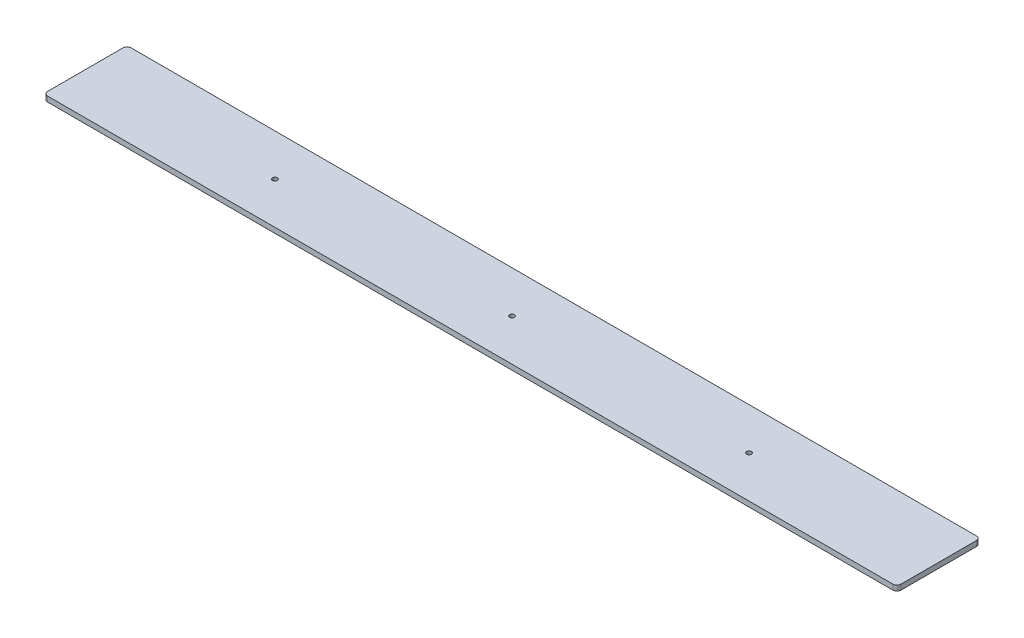
ISO-10303-21;
HEADER;
FILE_DESCRIPTION(('STEP AP214'),'2;1');
FILE_NAME('part.step','',(''),(''),'','','');
FILE_SCHEMA(('AUTOMOTIVE_DESIGN { 1 0 10303 214 1 1 1 1 }'));
ENDSEC;
DATA;
#1=APPLICATION_CONTEXT('core data for automotive mechanical design processes');
#2=APPLICATION_PROTOCOL_DEFINITION('international standard','automotive_design',2000,#1);
#3=PRODUCT_CONTEXT('',#1,'mechanical');
#4=PRODUCT('Part','Part','',(#3));
#5=PRODUCT_RELATED_PRODUCT_CATEGORY('part','',(#4));
#6=PRODUCT_DEFINITION_FORMATION('','',#4);
#7=PRODUCT_DEFINITION_CONTEXT('part definition',#1,'design');
#8=PRODUCT_DEFINITION('design','',#6,#7);
#9=PRODUCT_DEFINITION_SHAPE('','',#8);
#10=(LENGTH_UNIT() NAMED_UNIT(*) SI_UNIT(.MILLI.,.METRE.));
#11=(NAMED_UNIT(*) PLANE_ANGLE_UNIT() SI_UNIT($,.RADIAN.));
#12=(NAMED_UNIT(*) SI_UNIT($,.STERADIAN.) SOLID_ANGLE_UNIT());
#13=UNCERTAINTY_MEASURE_WITH_UNIT(LENGTH_MEASURE(1.E-05),#10,'distance_accuracy_value','');
#14=(GEOMETRIC_REPRESENTATION_CONTEXT(3) GLOBAL_UNCERTAINTY_ASSIGNED_CONTEXT((#13)) GLOBAL_UNIT_ASSIGNED_CONTEXT((#10,
#11,#12)) REPRESENTATION_CONTEXT('',''));
#15=CARTESIAN_POINT('',(0.,0.,0.));
#16=DIRECTION('',(0.,0.,1.));
#17=DIRECTION('',(1.,0.,0.));
#18=AXIS2_PLACEMENT_3D('',#15,#16,#17);
#19=CARTESIAN_POINT('',(259.55625,3.175,25.4));
#20=DIRECTION('',(-1.,0.,0.));
#21=DIRECTION('',(0.,0.,1.));
#22=AXIS2_PLACEMENT_3D('',#19,#20,#21);
#23=PLANE('',#22);
#24=DIRECTION('',(0.,0.,-1.));
#25=VECTOR('',#24,1.);
#26=CARTESIAN_POINT('',(259.55625,0.,25.4));
#27=LINE('',#26,#25);
#28=CARTESIAN_POINT('',(259.55625,0.,22.86));
#29=VERTEX_POINT('',#28);
#30=CARTESIAN_POINT('',(259.55625,0.,-22.86));
#31=VERTEX_POINT('',#30);
#32=EDGE_CURVE('E129',#29,#31,#27,.T.);
#33=ORIENTED_EDGE('',*,*,#32,.T.);
#34=DIRECTION('',(0.,-1.,0.));
#35=VECTOR('',#34,1.);
#36=CARTESIAN_POINT('',(259.55625,3.175,-22.86));
#37=LINE('',#36,#35);
#38=CARTESIAN_POINT('',(259.55625,3.175,-22.86));
#39=VERTEX_POINT('',#38);
#40=EDGE_CURVE('E11',#31,#39,#37,.F.);
#41=ORIENTED_EDGE('',*,*,#40,.T.);
#42=DIRECTION('',(0.,0.,-1.));
#43=VECTOR('',#42,1.);
#44=CARTESIAN_POINT('',(259.55625,3.175,25.4));
#45=LINE('',#44,#43);
#46=CARTESIAN_POINT('',(259.55625,3.175,22.86));
#47=VERTEX_POINT('',#46);
#48=EDGE_CURVE('E127',#47,#39,#45,.T.);
#49=ORIENTED_EDGE('',*,*,#48,.F.);
#50=DIRECTION('',(0.,-1.,0.));
#51=VECTOR('',#50,1.);
#52=CARTESIAN_POINT('',(259.55625,3.175,22.86));
#53=LINE('',#52,#51);
#54=EDGE_CURVE('E41',#47,#29,#53,.T.);
#55=ORIENTED_EDGE('',*,*,#54,.T.);
#56=EDGE_LOOP('',(#33,#41,#49,#55));
#57=FACE_BOUND('',#56,.T.);
#58=ADVANCED_FACE('F33',(#57),#23,.F.);
#59=CARTESIAN_POINT('',(-259.55625,3.175,-25.4));
#60=DIRECTION('',(0.,0.,1.));
#61=DIRECTION('',(1.,0.,0.));
#62=AXIS2_PLACEMENT_3D('',#59,#60,#61);
#63=PLANE('',#62);
#64=DIRECTION('',(-1.,0.,0.));
#65=VECTOR('',#64,1.);
#66=CARTESIAN_POINT('',(-259.55625,0.,-25.4));
#67=LINE('',#66,#65);
#68=CARTESIAN_POINT('',(257.01625,0.,-25.4));
#69=VERTEX_POINT('',#68);
#70=CARTESIAN_POINT('',(-257.01625,0.,-25.4));
#71=VERTEX_POINT('',#70);
#72=EDGE_CURVE('E125',#69,#71,#67,.T.);
#73=ORIENTED_EDGE('',*,*,#72,.T.);
#74=DIRECTION('',(0.,-1.,0.));
#75=VECTOR('',#74,1.);
#76=CARTESIAN_POINT('',(-257.01625,3.175,-25.4));
#77=LINE('',#76,#75);
#78=CARTESIAN_POINT('',(-257.01625,3.175,-25.4));
#79=VERTEX_POINT('',#78);
#80=EDGE_CURVE('E104',#71,#79,#77,.F.);
#81=ORIENTED_EDGE('',*,*,#80,.T.);
#82=DIRECTION('',(-1.,0.,0.));
#83=VECTOR('',#82,1.);
#84=CARTESIAN_POINT('',(-259.55625,3.175,-25.4));
#85=LINE('',#84,#83);
#86=CARTESIAN_POINT('',(257.01625,3.175,-25.4));
#87=VERTEX_POINT('',#86);
#88=EDGE_CURVE('E169',#87,#79,#85,.T.);
#89=ORIENTED_EDGE('',*,*,#88,.F.);
#90=DIRECTION('',(0.,-1.,0.));
#91=VECTOR('',#90,1.);
#92=CARTESIAN_POINT('',(257.01625,3.175,-25.4));
#93=LINE('',#92,#91);
#94=EDGE_CURVE('E109',#87,#69,#93,.T.);
#95=ORIENTED_EDGE('',*,*,#94,.T.);
#96=EDGE_LOOP('',(#73,#81,#89,#95));
#97=FACE_BOUND('',#96,.T.);
#98=ADVANCED_FACE('F213',(#97),#63,.F.);
#99=CARTESIAN_POINT('',(-259.55625,3.175,25.4));
#100=DIRECTION('',(1.,0.,0.));
#101=DIRECTION('',(0.,0.,-1.));
#102=AXIS2_PLACEMENT_3D('',#99,#100,#101);
#103=PLANE('',#102);
#104=DIRECTION('',(0.,0.,1.));
#105=VECTOR('',#104,1.);
#106=CARTESIAN_POINT('',(-259.55625,3.175,25.4));
#107=LINE('',#106,#105);
#108=CARTESIAN_POINT('',(-259.55625,3.175,-22.86));
#109=VERTEX_POINT('',#108);
#110=CARTESIAN_POINT('',(-259.55625,3.175,22.86));
#111=VERTEX_POINT('',#110);
#112=EDGE_CURVE('E118',#109,#111,#107,.T.);
#113=ORIENTED_EDGE('',*,*,#112,.F.);
#114=DIRECTION('',(0.,-1.,0.));
#115=VECTOR('',#114,1.);
#116=CARTESIAN_POINT('',(-259.55625,3.175,-22.86));
#117=LINE('',#116,#115);
#118=CARTESIAN_POINT('',(-259.55625,0.,-22.86));
#119=VERTEX_POINT('',#118);
#120=EDGE_CURVE('E103',#109,#119,#117,.T.);
#121=ORIENTED_EDGE('',*,*,#120,.T.);
#122=DIRECTION('',(0.,0.,1.));
#123=VECTOR('',#122,1.);
#124=CARTESIAN_POINT('',(-259.55625,0.,25.4));
#125=LINE('',#124,#123);
#126=CARTESIAN_POINT('',(-259.55625,0.,22.86));
#127=VERTEX_POINT('',#126);
#128=EDGE_CURVE('E116',#119,#127,#125,.T.);
#129=ORIENTED_EDGE('',*,*,#128,.T.);
#130=DIRECTION('',(0.,-1.,0.));
#131=VECTOR('',#130,1.);
#132=CARTESIAN_POINT('',(-259.55625,3.175,22.86));
#133=LINE('',#132,#131);
#134=EDGE_CURVE('E120',#127,#111,#133,.F.);
#135=ORIENTED_EDGE('',*,*,#134,.T.);
#136=EDGE_LOOP('',(#113,#121,#129,#135));
#137=FACE_BOUND('',#136,.T.);
#138=ADVANCED_FACE('F115',(#137),#103,.F.);
#139=CARTESIAN_POINT('',(-259.55625,3.175,25.4));
#140=DIRECTION('',(0.,0.,-1.));
#141=DIRECTION('',(-1.,0.,0.));
#142=AXIS2_PLACEMENT_3D('',#139,#140,#141);
#143=PLANE('',#142);
#144=DIRECTION('',(1.,0.,0.));
#145=VECTOR('',#144,1.);
#146=CARTESIAN_POINT('',(-259.55625,3.175,25.4));
#147=LINE('',#146,#145);
#148=CARTESIAN_POINT('',(-257.01625,3.175,25.4));
#149=VERTEX_POINT('',#148);
#150=CARTESIAN_POINT('',(257.01625,3.175,25.4));
#151=VERTEX_POINT('',#150);
#152=EDGE_CURVE('E133',#149,#151,#147,.T.);
#153=ORIENTED_EDGE('',*,*,#152,.F.);
#154=DIRECTION('',(0.,-1.,0.));
#155=VECTOR('',#154,1.);
#156=CARTESIAN_POINT('',(-257.01625,3.175,25.4));
#157=LINE('',#156,#155);
#158=CARTESIAN_POINT('',(-257.01625,0.,25.4));
#159=VERTEX_POINT('',#158);
#160=EDGE_CURVE('E150',#149,#159,#157,.T.);
#161=ORIENTED_EDGE('',*,*,#160,.T.);
#162=DIRECTION('',(1.,0.,0.));
#163=VECTOR('',#162,1.);
#164=CARTESIAN_POINT('',(-259.55625,0.,25.4));
#165=LINE('',#164,#163);
#166=CARTESIAN_POINT('',(257.01625,0.,25.4));
#167=VERTEX_POINT('',#166);
#168=EDGE_CURVE('E124',#159,#167,#165,.T.);
#169=ORIENTED_EDGE('',*,*,#168,.T.);
#170=DIRECTION('',(0.,-1.,0.));
#171=VECTOR('',#170,1.);
#172=CARTESIAN_POINT('',(257.01625,3.175,25.4));
#173=LINE('',#172,#171);
#174=EDGE_CURVE('E48',#167,#151,#173,.F.);
#175=ORIENTED_EDGE('',*,*,#174,.T.);
#176=EDGE_LOOP('',(#153,#161,#169,#175));
#177=FACE_BOUND('',#176,.T.);
#178=ADVANCED_FACE('F235',(#177),#143,.F.);
#179=CARTESIAN_POINT('',(0.,3.175,0.));
#180=DIRECTION('',(0.,-1.,0.));
#181=DIRECTION('',(0.,0.,-1.));
#182=AXIS2_PLACEMENT_3D('',#179,#180,#181);
#183=PLANE('',#182);
#184=CARTESIAN_POINT('',(144.19199,3.175,0.));
#185=DIRECTION('',(0.,-1.,0.));
#186=DIRECTION('',(0.,0.,-1.));
#187=AXIS2_PLACEMENT_3D('',#184,#185,#186);
#188=CIRCLE('',#187,1.47320000000001);
#189=CARTESIAN_POINT('',(144.19199,3.175,-1.47319999999998));
#190=VERTEX_POINT('',#189);
#191=EDGE_CURVE('E181',#190,#190,#188,.T.);
#192=ORIENTED_EDGE('',*,*,#191,.T.);
#193=EDGE_LOOP('',(#192));
#194=FACE_BOUND('',#193,.T.);
#195=CARTESIAN_POINT('',(0.,3.175,0.));
#196=DIRECTION('',(0.,-1.,0.));
#197=DIRECTION('',(0.,0.,-1.));
#198=AXIS2_PLACEMENT_3D('',#195,#196,#197);
#199=CIRCLE('',#198,1.4732);
#200=CARTESIAN_POINT('',(0.,3.175,-1.4732));
#201=VERTEX_POINT('',#200);
#202=EDGE_CURVE('E175',#201,#201,#199,.T.);
#203=ORIENTED_EDGE('',*,*,#202,.T.);
#204=EDGE_LOOP('',(#203));
#205=FACE_BOUND('',#204,.T.);
#206=CARTESIAN_POINT('',(-144.19961,3.175,0.));
#207=DIRECTION('',(0.,-1.,0.));
#208=DIRECTION('',(0.,0.,-1.));
#209=AXIS2_PLACEMENT_3D('',#206,#207,#208);
#210=CIRCLE('',#209,1.47320000000001);
#211=CARTESIAN_POINT('',(-144.19961,3.175,-1.47319999999998));
#212=VERTEX_POINT('',#211);
#213=EDGE_CURVE('E162',#212,#212,#210,.T.);
#214=ORIENTED_EDGE('',*,*,#213,.T.);
#215=EDGE_LOOP('',(#214));
#216=FACE_BOUND('',#215,.T.);
#217=ORIENTED_EDGE('',*,*,#88,.T.);
#218=CARTESIAN_POINT('',(-257.01625,3.175,-22.86));
#219=DIRECTION('',(0.,-1.,0.));
#220=DIRECTION('',(0.,0.,-1.));
#221=AXIS2_PLACEMENT_3D('',#218,#219,#220);
#222=CIRCLE('',#221,2.54);
#223=EDGE_CURVE('E147',#79,#109,#222,.F.);
#224=ORIENTED_EDGE('',*,*,#223,.T.);
#225=ORIENTED_EDGE('',*,*,#112,.T.);
#226=CARTESIAN_POINT('',(-257.01625,3.175,22.86));
#227=DIRECTION('',(0.,-1.,0.));
#228=DIRECTION('',(0.,0.,-1.));
#229=AXIS2_PLACEMENT_3D('',#226,#227,#228);
#230=CIRCLE('',#229,2.54);
#231=EDGE_CURVE('E55',#111,#149,#230,.F.);
#232=ORIENTED_EDGE('',*,*,#231,.T.);
#233=ORIENTED_EDGE('',*,*,#152,.T.);
#234=CARTESIAN_POINT('',(257.01625,3.175,22.86));
#235=DIRECTION('',(0.,-1.,0.));
#236=DIRECTION('',(0.,0.,-1.));
#237=AXIS2_PLACEMENT_3D('',#234,#235,#236);
#238=CIRCLE('',#237,2.54);
#239=EDGE_CURVE('E142',#151,#47,#238,.F.);
#240=ORIENTED_EDGE('',*,*,#239,.T.);
#241=ORIENTED_EDGE('',*,*,#48,.T.);
#242=CARTESIAN_POINT('',(257.01625,3.175,-22.86));
#243=DIRECTION('',(0.,-1.,0.));
#244=DIRECTION('',(0.,0.,-1.));
#245=AXIS2_PLACEMENT_3D('',#242,#243,#244);
#246=CIRCLE('',#245,2.54);
#247=EDGE_CURVE('E144',#39,#87,#246,.F.);
#248=ORIENTED_EDGE('',*,*,#247,.T.);
#249=EDGE_LOOP('',(#217,#224,#225,#232,#233,#240,#241,#248));
#250=FACE_BOUND('',#249,.T.);
#251=ADVANCED_FACE('F192',(#194,#205,#216,#250),#183,.F.);
#252=CARTESIAN_POINT('',(0.,0.,0.));
#253=DIRECTION('',(0.,-1.,0.));
#254=DIRECTION('',(0.,0.,-1.));
#255=AXIS2_PLACEMENT_3D('',#252,#253,#254);
#256=PLANE('',#255);
#257=CARTESIAN_POINT('',(144.19199,0.,0.));
#258=DIRECTION('',(0.,-1.,0.));
#259=DIRECTION('',(0.,0.,-1.));
#260=AXIS2_PLACEMENT_3D('',#257,#258,#259);
#261=CIRCLE('',#260,1.47319999999998);
#262=CARTESIAN_POINT('',(144.19199,0.,-1.47319999999995));
#263=VERTEX_POINT('',#262);
#264=EDGE_CURVE('E184',#263,#263,#261,.T.);
#265=ORIENTED_EDGE('',*,*,#264,.F.);
#266=EDGE_LOOP('',(#265));
#267=FACE_BOUND('',#266,.T.);
#268=CARTESIAN_POINT('',(0.,0.,0.));
#269=DIRECTION('',(0.,-1.,0.));
#270=DIRECTION('',(0.,0.,-1.));
#271=AXIS2_PLACEMENT_3D('',#268,#269,#270);
#272=CIRCLE('',#271,1.47319999999999);
#273=CARTESIAN_POINT('',(0.,0.,-1.47319999999999));
#274=VERTEX_POINT('',#273);
#275=EDGE_CURVE('E178',#274,#274,#272,.T.);
#276=ORIENTED_EDGE('',*,*,#275,.F.);
#277=EDGE_LOOP('',(#276));
#278=FACE_BOUND('',#277,.T.);
#279=CARTESIAN_POINT('',(-144.19961,0.,0.));
#280=DIRECTION('',(0.,-1.,0.));
#281=DIRECTION('',(0.,0.,-1.));
#282=AXIS2_PLACEMENT_3D('',#279,#280,#281);
#283=CIRCLE('',#282,1.47319999999998);
#284=CARTESIAN_POINT('',(-144.19961,0.,-1.47319999999995));
#285=VERTEX_POINT('',#284);
#286=EDGE_CURVE('E164',#285,#285,#283,.T.);
#287=ORIENTED_EDGE('',*,*,#286,.F.);
#288=EDGE_LOOP('',(#287));
#289=FACE_BOUND('',#288,.T.);
#290=ORIENTED_EDGE('',*,*,#128,.F.);
#291=CARTESIAN_POINT('',(-257.01625,0.,-22.86));
#292=DIRECTION('',(0.,-1.,0.));
#293=DIRECTION('',(0.,0.,-1.));
#294=AXIS2_PLACEMENT_3D('',#291,#292,#293);
#295=CIRCLE('',#294,2.54);
#296=EDGE_CURVE('E99',#119,#71,#295,.T.);
#297=ORIENTED_EDGE('',*,*,#296,.T.);
#298=ORIENTED_EDGE('',*,*,#72,.F.);
#299=CARTESIAN_POINT('',(257.01625,0.,-22.86));
#300=DIRECTION('',(0.,-1.,0.));
#301=DIRECTION('',(0.,0.,-1.));
#302=AXIS2_PLACEMENT_3D('',#299,#300,#301);
#303=CIRCLE('',#302,2.54);
#304=EDGE_CURVE('E136',#69,#31,#303,.T.);
#305=ORIENTED_EDGE('',*,*,#304,.T.);
#306=ORIENTED_EDGE('',*,*,#32,.F.);
#307=CARTESIAN_POINT('',(257.01625,0.,22.86));
#308=DIRECTION('',(0.,-1.,0.));
#309=DIRECTION('',(0.,0.,-1.));
#310=AXIS2_PLACEMENT_3D('',#307,#308,#309);
#311=CIRCLE('',#310,2.54);
#312=EDGE_CURVE('E119',#29,#167,#311,.T.);
#313=ORIENTED_EDGE('',*,*,#312,.T.);
#314=ORIENTED_EDGE('',*,*,#168,.F.);
#315=CARTESIAN_POINT('',(-257.01625,0.,22.86));
#316=DIRECTION('',(0.,-1.,0.));
#317=DIRECTION('',(0.,0.,-1.));
#318=AXIS2_PLACEMENT_3D('',#315,#316,#317);
#319=CIRCLE('',#318,2.54);
#320=EDGE_CURVE('E110',#159,#127,#319,.T.);
#321=ORIENTED_EDGE('',*,*,#320,.T.);
#322=EDGE_LOOP('',(#290,#297,#298,#305,#306,#313,#314,#321));
#323=FACE_BOUND('',#322,.T.);
#324=ADVANCED_FACE('F122',(#267,#278,#289,#323),#256,.T.);
#325=CARTESIAN_POINT('',(-257.01625,3.175,-22.86));
#326=DIRECTION('',(0.,-1.,0.));
#327=DIRECTION('',(0.,0.,-1.));
#328=AXIS2_PLACEMENT_3D('',#325,#326,#327);
#329=CYLINDRICAL_SURFACE('',#328,2.54);
#330=ORIENTED_EDGE('',*,*,#223,.F.);
#331=ORIENTED_EDGE('',*,*,#80,.F.);
#332=ORIENTED_EDGE('',*,*,#296,.F.);
#333=ORIENTED_EDGE('',*,*,#120,.F.);
#334=EDGE_LOOP('',(#330,#331,#332,#333));
#335=FACE_BOUND('',#334,.T.);
#336=ADVANCED_FACE('F102',(#335),#329,.T.);
#337=CARTESIAN_POINT('',(-257.01625,3.175,22.86));
#338=DIRECTION('',(0.,-1.,0.));
#339=DIRECTION('',(0.,0.,-1.));
#340=AXIS2_PLACEMENT_3D('',#337,#338,#339);
#341=CYLINDRICAL_SURFACE('',#340,2.54);
#342=ORIENTED_EDGE('',*,*,#231,.F.);
#343=ORIENTED_EDGE('',*,*,#134,.F.);
#344=ORIENTED_EDGE('',*,*,#320,.F.);
#345=ORIENTED_EDGE('',*,*,#160,.F.);
#346=EDGE_LOOP('',(#342,#343,#344,#345));
#347=FACE_BOUND('',#346,.T.);
#348=ADVANCED_FACE('F224',(#347),#341,.T.);
#349=CARTESIAN_POINT('',(257.01625,3.175,-22.86));
#350=DIRECTION('',(0.,-1.,0.));
#351=DIRECTION('',(0.,0.,-1.));
#352=AXIS2_PLACEMENT_3D('',#349,#350,#351);
#353=CYLINDRICAL_SURFACE('',#352,2.54);
#354=ORIENTED_EDGE('',*,*,#247,.F.);
#355=ORIENTED_EDGE('',*,*,#40,.F.);
#356=ORIENTED_EDGE('',*,*,#304,.F.);
#357=ORIENTED_EDGE('',*,*,#94,.F.);
#358=EDGE_LOOP('',(#354,#355,#356,#357));
#359=FACE_BOUND('',#358,.T.);
#360=ADVANCED_FACE('F209',(#359),#353,.T.);
#361=CARTESIAN_POINT('',(257.01625,3.175,22.86));
#362=DIRECTION('',(0.,-1.,0.));
#363=DIRECTION('',(0.,0.,-1.));
#364=AXIS2_PLACEMENT_3D('',#361,#362,#363);
#365=CYLINDRICAL_SURFACE('',#364,2.54);
#366=ORIENTED_EDGE('',*,*,#239,.F.);
#367=ORIENTED_EDGE('',*,*,#174,.F.);
#368=ORIENTED_EDGE('',*,*,#312,.F.);
#369=ORIENTED_EDGE('',*,*,#54,.F.);
#370=EDGE_LOOP('',(#366,#367,#368,#369));
#371=FACE_BOUND('',#370,.T.);
#372=ADVANCED_FACE('F35',(#371),#365,.T.);
#373=CARTESIAN_POINT('',(-144.19961,0.,0.));
#374=DIRECTION('',(0.,-1.,0.));
#375=DIRECTION('',(0.,0.,-1.));
#376=AXIS2_PLACEMENT_3D('',#373,#374,#375);
#377=CYLINDRICAL_SURFACE('',#376,1.47319999999999);
#378=ORIENTED_EDGE('',*,*,#213,.F.);
#379=EDGE_LOOP('',(#378));
#380=FACE_BOUND('',#379,.T.);
#381=ORIENTED_EDGE('',*,*,#286,.T.);
#382=EDGE_LOOP('',(#381));
#383=FACE_BOUND('',#382,.T.);
#384=ADVANCED_FACE('F198',(#380,#383),#377,.F.);
#385=CARTESIAN_POINT('',(0.,0.,0.));
#386=DIRECTION('',(0.,-1.,0.));
#387=DIRECTION('',(0.,0.,-1.));
#388=AXIS2_PLACEMENT_3D('',#385,#386,#387);
#389=CYLINDRICAL_SURFACE('',#388,1.47319999999999);
#390=ORIENTED_EDGE('',*,*,#202,.F.);
#391=EDGE_LOOP('',(#390));
#392=FACE_BOUND('',#391,.T.);
#393=ORIENTED_EDGE('',*,*,#275,.T.);
#394=EDGE_LOOP('',(#393));
#395=FACE_BOUND('',#394,.T.);
#396=ADVANCED_FACE('F200',(#392,#395),#389,.F.);
#397=CARTESIAN_POINT('',(144.19199,0.,0.));
#398=DIRECTION('',(0.,-1.,0.));
#399=DIRECTION('',(0.,0.,-1.));
#400=AXIS2_PLACEMENT_3D('',#397,#398,#399);
#401=CYLINDRICAL_SURFACE('',#400,1.47319999999999);
#402=ORIENTED_EDGE('',*,*,#191,.F.);
#403=EDGE_LOOP('',(#402));
#404=FACE_BOUND('',#403,.T.);
#405=ORIENTED_EDGE('',*,*,#264,.T.);
#406=EDGE_LOOP('',(#405));
#407=FACE_BOUND('',#406,.T.);
#408=ADVANCED_FACE('F188',(#404,#407),#401,.F.);
#409=CLOSED_SHELL('',(#58,#98,#138,#178,#251,#324,#336,#348,#360,#372,#384,#396,#408));
#410=MANIFOLD_SOLID_BREP('B2',#409);
#411=ADVANCED_BREP_SHAPE_REPRESENTATION('',(#18,#410),#14);
#412=SHAPE_DEFINITION_REPRESENTATION(#9,#411);
ENDSEC;
END-ISO-10303-21;
